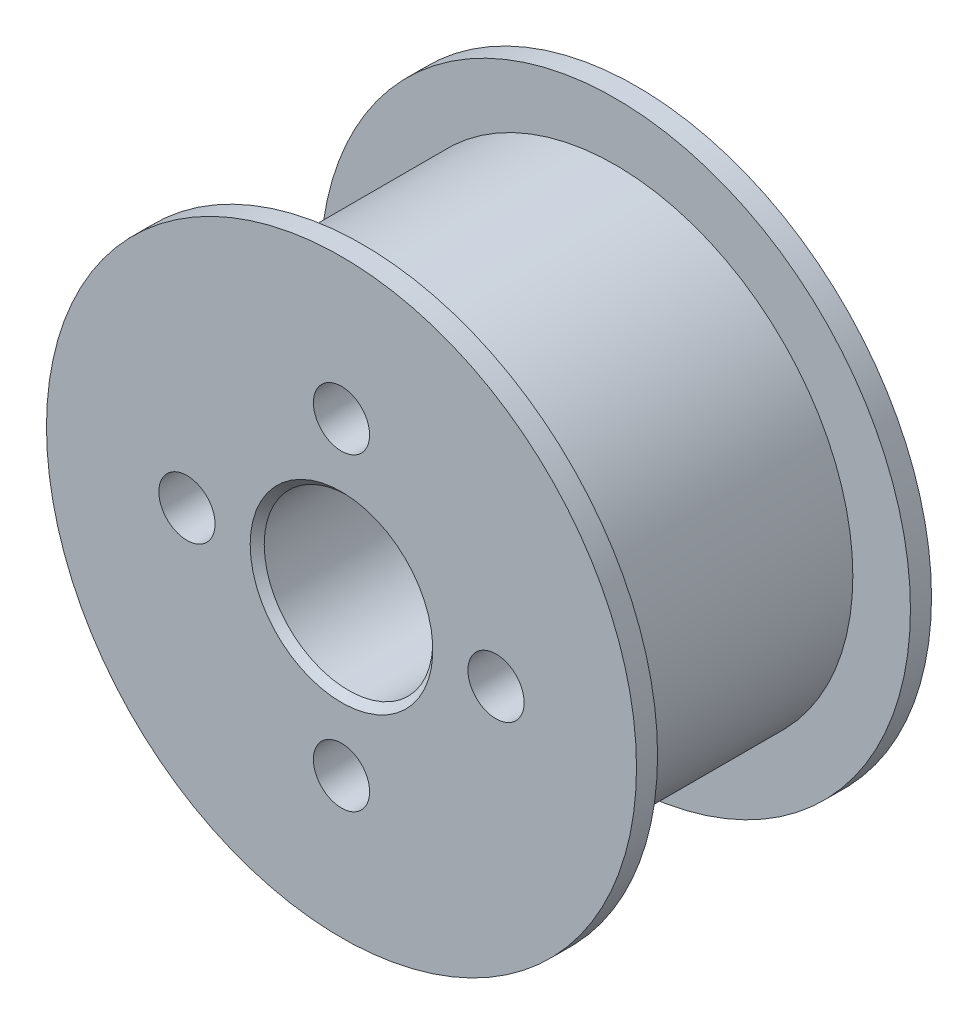
ISO-10303-21;
HEADER;
FILE_DESCRIPTION(('STEP AP214'),'2;1');
FILE_NAME('part.step','',(''),(''),'','','');
FILE_SCHEMA(('AUTOMOTIVE_DESIGN { 1 0 10303 214 1 1 1 1 }'));
ENDSEC;
DATA;
#1=APPLICATION_CONTEXT('core data for automotive mechanical design processes');
#2=APPLICATION_PROTOCOL_DEFINITION('international standard','automotive_design',2000,#1);
#3=PRODUCT_CONTEXT('',#1,'mechanical');
#4=PRODUCT('Part','Part','',(#3));
#5=PRODUCT_RELATED_PRODUCT_CATEGORY('part','',(#4));
#6=PRODUCT_DEFINITION_FORMATION('','',#4);
#7=PRODUCT_DEFINITION_CONTEXT('part definition',#1,'design');
#8=PRODUCT_DEFINITION('design','',#6,#7);
#9=PRODUCT_DEFINITION_SHAPE('','',#8);
#10=(LENGTH_UNIT() NAMED_UNIT(*) SI_UNIT(.MILLI.,.METRE.));
#11=(NAMED_UNIT(*) PLANE_ANGLE_UNIT() SI_UNIT($,.RADIAN.));
#12=(NAMED_UNIT(*) SI_UNIT($,.STERADIAN.) SOLID_ANGLE_UNIT());
#13=UNCERTAINTY_MEASURE_WITH_UNIT(LENGTH_MEASURE(1.E-05),#10,'distance_accuracy_value','');
#14=(GEOMETRIC_REPRESENTATION_CONTEXT(3) GLOBAL_UNCERTAINTY_ASSIGNED_CONTEXT((#13)) GLOBAL_UNIT_ASSIGNED_CONTEXT((#10,
#11,#12)) REPRESENTATION_CONTEXT('',''));
#15=CARTESIAN_POINT('',(0.,0.,0.));
#16=DIRECTION('',(0.,0.,1.));
#17=DIRECTION('',(1.,0.,0.));
#18=AXIS2_PLACEMENT_3D('',#15,#16,#17);
#19=CARTESIAN_POINT('',(0.,13.,-26.));
#20=DIRECTION('',(0.,0.,1.));
#21=DIRECTION('',(1.,0.,0.));
#22=AXIS2_PLACEMENT_3D('',#19,#20,#21);
#23=PLANE('',#22);
#24=CARTESIAN_POINT('',(0.,0.,-26.));
#25=DIRECTION('',(0.,0.,-1.));
#26=DIRECTION('',(0.,1.,0.));
#27=AXIS2_PLACEMENT_3D('',#24,#25,#26);
#28=CIRCLE('',#27,6.);
#29=CARTESIAN_POINT('',(0.,6.,-26.));
#30=VERTEX_POINT('',#29);
#31=EDGE_CURVE('E151',#30,#30,#28,.T.);
#32=ORIENTED_EDGE('',*,*,#31,.F.);
#33=EDGE_LOOP('',(#32));
#34=FACE_BOUND('',#33,.T.);
#35=CARTESIAN_POINT('',(0.,11.,-26.));
#36=DIRECTION('',(0.,0.,-1.));
#37=DIRECTION('',(-1.,0.,0.));
#38=AXIS2_PLACEMENT_3D('',#35,#36,#37);
#39=CIRCLE('',#38,3.99999999999999);
#40=CARTESIAN_POINT('',(3.72616391489439,12.4545454545455,-26.));
#41=VERTEX_POINT('',#40);
#42=CARTESIAN_POINT('',(-3.72616391489439,12.4545454545455,-26.));
#43=VERTEX_POINT('',#42);
#44=EDGE_CURVE('E105',#41,#43,#39,.T.);
#45=ORIENTED_EDGE('',*,*,#44,.F.);
#46=CARTESIAN_POINT('',(0.,0.,-26.));
#47=DIRECTION('',(0.,0.,1.));
#48=DIRECTION('',(1.,0.,0.));
#49=AXIS2_PLACEMENT_3D('',#46,#47,#48);
#50=CIRCLE('',#49,13.);
#51=CARTESIAN_POINT('',(12.4545454545455,3.72616391489439,-26.));
#52=VERTEX_POINT('',#51);
#53=EDGE_CURVE('E114',#52,#41,#50,.T.);
#54=ORIENTED_EDGE('',*,*,#53,.F.);
#55=CARTESIAN_POINT('',(11.,0.,-26.));
#56=DIRECTION('',(0.,0.,-1.));
#57=DIRECTION('',(-1.,0.,0.));
#58=AXIS2_PLACEMENT_3D('',#55,#56,#57);
#59=CIRCLE('',#58,3.99999999999999);
#60=CARTESIAN_POINT('',(12.4545454545455,-3.72616391489439,-26.));
#61=VERTEX_POINT('',#60);
#62=EDGE_CURVE('E166',#61,#52,#59,.T.);
#63=ORIENTED_EDGE('',*,*,#62,.F.);
#64=CARTESIAN_POINT('',(3.72616391489439,-12.4545454545455,-26.));
#65=VERTEX_POINT('',#64);
#66=EDGE_CURVE('E122',#65,#61,#50,.T.);
#67=ORIENTED_EDGE('',*,*,#66,.F.);
#68=CARTESIAN_POINT('',(0.,-11.,-26.));
#69=DIRECTION('',(0.,0.,-1.));
#70=DIRECTION('',(-1.,0.,0.));
#71=AXIS2_PLACEMENT_3D('',#68,#69,#70);
#72=CIRCLE('',#71,3.99999999999999);
#73=CARTESIAN_POINT('',(-3.72616391489439,-12.4545454545455,-26.));
#74=VERTEX_POINT('',#73);
#75=EDGE_CURVE('E182',#74,#65,#72,.T.);
#76=ORIENTED_EDGE('',*,*,#75,.F.);
#77=CARTESIAN_POINT('',(-12.4545454545455,-3.72616391489439,-26.));
#78=VERTEX_POINT('',#77);
#79=EDGE_CURVE('E126',#78,#74,#50,.T.);
#80=ORIENTED_EDGE('',*,*,#79,.F.);
#81=CARTESIAN_POINT('',(-11.,0.,-26.));
#82=DIRECTION('',(0.,0.,-1.));
#83=DIRECTION('',(-1.,0.,0.));
#84=AXIS2_PLACEMENT_3D('',#81,#82,#83);
#85=CIRCLE('',#84,3.99999999999999);
#86=CARTESIAN_POINT('',(-12.4545454545455,3.72616391489439,-26.));
#87=VERTEX_POINT('',#86);
#88=EDGE_CURVE('E197',#87,#78,#85,.T.);
#89=ORIENTED_EDGE('',*,*,#88,.F.);
#90=EDGE_CURVE('E208',#43,#87,#50,.T.);
#91=ORIENTED_EDGE('',*,*,#90,.F.);
#92=EDGE_LOOP('',(#45,#54,#63,#67,#76,#80,#89,#91));
#93=FACE_BOUND('',#92,.T.);
#94=ADVANCED_FACE('F35',(#34,#93),#23,.F.);
#95=CARTESIAN_POINT('',(0.,0.,0.));
#96=DIRECTION('',(0.,0.,1.));
#97=DIRECTION('',(1.,0.,0.));
#98=AXIS2_PLACEMENT_3D('',#95,#96,#97);
#99=CYLINDRICAL_SURFACE('',#98,13.);
#100=CARTESIAN_POINT('',(0.,0.,-21.));
#101=DIRECTION('',(0.,0.,1.));
#102=DIRECTION('',(1.,0.,0.));
#103=AXIS2_PLACEMENT_3D('',#100,#101,#102);
#104=CIRCLE('',#103,13.);
#105=CARTESIAN_POINT('',(-3.7261639148944,12.4545454545455,-21.));
#106=VERTEX_POINT('',#105);
#107=CARTESIAN_POINT('',(-12.4545454545455,3.7261639148944,-21.));
#108=VERTEX_POINT('',#107);
#109=EDGE_CURVE('E123',#106,#108,#104,.T.);
#110=ORIENTED_EDGE('',*,*,#109,.F.);
#111=DIRECTION('',(0.,0.,-1.));
#112=VECTOR('',#111,1.);
#113=CARTESIAN_POINT('',(-3.72616391489439,12.4545454545455,-23.5));
#114=LINE('',#113,#112);
#115=EDGE_CURVE('E102',#106,#43,#114,.T.);
#116=ORIENTED_EDGE('',*,*,#115,.T.);
#117=ORIENTED_EDGE('',*,*,#90,.T.);
#118=DIRECTION('',(0.,0.,-1.));
#119=VECTOR('',#118,1.);
#120=CARTESIAN_POINT('',(-12.4545454545455,3.72616391489439,-23.5));
#121=LINE('',#120,#119);
#122=EDGE_CURVE('E187',#87,#108,#121,.F.);
#123=ORIENTED_EDGE('',*,*,#122,.T.);
#124=EDGE_LOOP('',(#110,#116,#117,#123));
#125=FACE_BOUND('',#124,.T.);
#126=ADVANCED_FACE('F207',(#125),#99,.T.);
#127=CARTESIAN_POINT('',(-12.4545454545455,-3.7261639148944,-21.));
#128=VERTEX_POINT('',#127);
#129=CARTESIAN_POINT('',(-3.7261639148944,-12.4545454545455,-21.));
#130=VERTEX_POINT('',#129);
#131=EDGE_CURVE('E128',#128,#130,#104,.T.);
#132=ORIENTED_EDGE('',*,*,#131,.F.);
#133=DIRECTION('',(0.,0.,-1.));
#134=VECTOR('',#133,1.);
#135=CARTESIAN_POINT('',(-12.4545454545455,-3.72616391489439,-23.5));
#136=LINE('',#135,#134);
#137=EDGE_CURVE('E184',#128,#78,#136,.T.);
#138=ORIENTED_EDGE('',*,*,#137,.T.);
#139=ORIENTED_EDGE('',*,*,#79,.T.);
#140=DIRECTION('',(0.,0.,-1.));
#141=VECTOR('',#140,1.);
#142=CARTESIAN_POINT('',(-3.72616391489439,-12.4545454545455,-23.5));
#143=LINE('',#142,#141);
#144=EDGE_CURVE('E171',#74,#130,#143,.F.);
#145=ORIENTED_EDGE('',*,*,#144,.T.);
#146=EDGE_LOOP('',(#132,#138,#139,#145));
#147=FACE_BOUND('',#146,.T.);
#148=ADVANCED_FACE('F233',(#147),#99,.T.);
#149=CARTESIAN_POINT('',(3.7261639148944,-12.4545454545455,-21.));
#150=VERTEX_POINT('',#149);
#151=CARTESIAN_POINT('',(12.4545454545455,-3.7261639148944,-21.));
#152=VERTEX_POINT('',#151);
#153=EDGE_CURVE('E125',#150,#152,#104,.T.);
#154=ORIENTED_EDGE('',*,*,#153,.F.);
#155=DIRECTION('',(0.,0.,-1.));
#156=VECTOR('',#155,1.);
#157=CARTESIAN_POINT('',(3.72616391489439,-12.4545454545455,-23.5));
#158=LINE('',#157,#156);
#159=EDGE_CURVE('E168',#150,#65,#158,.T.);
#160=ORIENTED_EDGE('',*,*,#159,.T.);
#161=ORIENTED_EDGE('',*,*,#66,.T.);
#162=DIRECTION('',(0.,0.,-1.));
#163=VECTOR('',#162,1.);
#164=CARTESIAN_POINT('',(12.4545454545455,-3.72616391489439,-23.5));
#165=LINE('',#164,#163);
#166=EDGE_CURVE('E156',#61,#152,#165,.F.);
#167=ORIENTED_EDGE('',*,*,#166,.T.);
#168=EDGE_LOOP('',(#154,#160,#161,#167));
#169=FACE_BOUND('',#168,.T.);
#170=ADVANCED_FACE('F238',(#169),#99,.T.);
#171=CARTESIAN_POINT('',(0.,21.,0.));
#172=DIRECTION('',(0.,0.,-1.));
#173=DIRECTION('',(-1.,0.,0.));
#174=AXIS2_PLACEMENT_3D('',#171,#172,#173);
#175=PLANE('',#174);
#176=CARTESIAN_POINT('',(0.,0.,0.));
#177=DIRECTION('',(0.,0.,-1.));
#178=DIRECTION('',(-1.,0.,0.));
#179=AXIS2_PLACEMENT_3D('',#176,#177,#178);
#180=CIRCLE('',#179,6.49999999999999);
#181=CARTESIAN_POINT('',(-6.49999999999999,0.,0.));
#182=VERTEX_POINT('',#181);
#183=EDGE_CURVE('E43',#182,#182,#180,.T.);
#184=ORIENTED_EDGE('',*,*,#183,.T.);
#185=EDGE_LOOP('',(#184));
#186=FACE_BOUND('',#185,.T.);
#187=CARTESIAN_POINT('',(0.,11.,0.));
#188=DIRECTION('',(0.,0.,-1.));
#189=DIRECTION('',(-1.,0.,0.));
#190=AXIS2_PLACEMENT_3D('',#187,#188,#189);
#191=CIRCLE('',#190,2.);
#192=CARTESIAN_POINT('',(-2.,11.,0.));
#193=VERTEX_POINT('',#192);
#194=EDGE_CURVE('E115',#193,#193,#191,.T.);
#195=ORIENTED_EDGE('',*,*,#194,.T.);
#196=EDGE_LOOP('',(#195));
#197=FACE_BOUND('',#196,.T.);
#198=CARTESIAN_POINT('',(-11.,0.,0.));
#199=DIRECTION('',(0.,0.,-1.));
#200=DIRECTION('',(-1.,0.,0.));
#201=AXIS2_PLACEMENT_3D('',#198,#199,#200);
#202=CIRCLE('',#201,2.);
#203=CARTESIAN_POINT('',(-13.,0.,0.));
#204=VERTEX_POINT('',#203);
#205=EDGE_CURVE('E190',#204,#204,#202,.T.);
#206=ORIENTED_EDGE('',*,*,#205,.T.);
#207=EDGE_LOOP('',(#206));
#208=FACE_BOUND('',#207,.T.);
#209=CARTESIAN_POINT('',(0.,-11.,0.));
#210=DIRECTION('',(0.,0.,-1.));
#211=DIRECTION('',(-1.,0.,0.));
#212=AXIS2_PLACEMENT_3D('',#209,#210,#211);
#213=CIRCLE('',#212,2.);
#214=CARTESIAN_POINT('',(-2.,-11.,0.));
#215=VERTEX_POINT('',#214);
#216=EDGE_CURVE('E174',#215,#215,#213,.T.);
#217=ORIENTED_EDGE('',*,*,#216,.T.);
#218=EDGE_LOOP('',(#217));
#219=FACE_BOUND('',#218,.T.);
#220=CARTESIAN_POINT('',(11.,0.,0.));
#221=DIRECTION('',(0.,0.,-1.));
#222=DIRECTION('',(-1.,0.,0.));
#223=AXIS2_PLACEMENT_3D('',#220,#221,#222);
#224=CIRCLE('',#223,2.);
#225=CARTESIAN_POINT('',(9.,0.,0.));
#226=VERTEX_POINT('',#225);
#227=EDGE_CURVE('E159',#226,#226,#224,.T.);
#228=ORIENTED_EDGE('',*,*,#227,.T.);
#229=EDGE_LOOP('',(#228));
#230=FACE_BOUND('',#229,.T.);
#231=CARTESIAN_POINT('',(0.,0.,0.));
#232=DIRECTION('',(0.,0.,1.));
#233=DIRECTION('',(1.,0.,0.));
#234=AXIS2_PLACEMENT_3D('',#231,#232,#233);
#235=CIRCLE('',#234,21.);
#236=CARTESIAN_POINT('',(21.,0.,0.));
#237=VERTEX_POINT('',#236);
#238=EDGE_CURVE('E148',#237,#237,#235,.T.);
#239=ORIENTED_EDGE('',*,*,#238,.T.);
#240=EDGE_LOOP('',(#239));
#241=FACE_BOUND('',#240,.T.);
#242=ADVANCED_FACE('F215',(#186,#197,#208,#219,#230,#241),#175,.F.);
#243=ORIENTED_EDGE('',*,*,#53,.T.);
#244=DIRECTION('',(0.,0.,-1.));
#245=VECTOR('',#244,1.);
#246=CARTESIAN_POINT('',(3.72616391489439,12.4545454545455,-23.5));
#247=LINE('',#246,#245);
#248=CARTESIAN_POINT('',(3.7261639148944,12.4545454545455,-21.));
#249=VERTEX_POINT('',#248);
#250=EDGE_CURVE('E99',#41,#249,#247,.F.);
#251=ORIENTED_EDGE('',*,*,#250,.T.);
#252=CARTESIAN_POINT('',(12.4545454545455,3.7261639148944,-21.));
#253=VERTEX_POINT('',#252);
#254=EDGE_CURVE('E112',#253,#249,#104,.T.);
#255=ORIENTED_EDGE('',*,*,#254,.F.);
#256=DIRECTION('',(0.,0.,-1.));
#257=VECTOR('',#256,1.);
#258=CARTESIAN_POINT('',(12.4545454545455,3.72616391489439,-23.5));
#259=LINE('',#258,#257);
#260=EDGE_CURVE('E154',#253,#52,#259,.T.);
#261=ORIENTED_EDGE('',*,*,#260,.T.);
#262=EDGE_LOOP('',(#243,#251,#255,#261));
#263=FACE_BOUND('',#262,.T.);
#264=ADVANCED_FACE('F110',(#263),#99,.T.);
#265=CARTESIAN_POINT('',(0.,13.,-21.));
#266=DIRECTION('',(0.,0.,1.));
#267=DIRECTION('',(1.,0.,0.));
#268=AXIS2_PLACEMENT_3D('',#265,#266,#267);
#269=PLANE('',#268);
#270=CARTESIAN_POINT('',(0.,11.,-21.));
#271=DIRECTION('',(0.,0.,-1.));
#272=DIRECTION('',(-1.,0.,0.));
#273=AXIS2_PLACEMENT_3D('',#270,#271,#272);
#274=CIRCLE('',#273,2.);
#275=CARTESIAN_POINT('',(-2.,11.,-21.));
#276=VERTEX_POINT('',#275);
#277=EDGE_CURVE('E104',#276,#276,#274,.T.);
#278=ORIENTED_EDGE('',*,*,#277,.F.);
#279=EDGE_LOOP('',(#278));
#280=FACE_BOUND('',#279,.T.);
#281=ORIENTED_EDGE('',*,*,#254,.T.);
#282=CARTESIAN_POINT('',(0.,11.,-21.));
#283=DIRECTION('',(0.,0.,-1.));
#284=DIRECTION('',(-1.,0.,0.));
#285=AXIS2_PLACEMENT_3D('',#282,#283,#284);
#286=CIRCLE('',#285,4.);
#287=EDGE_CURVE('E50',#249,#106,#286,.T.);
#288=ORIENTED_EDGE('',*,*,#287,.T.);
#289=ORIENTED_EDGE('',*,*,#109,.T.);
#290=CARTESIAN_POINT('',(-11.,0.,-21.));
#291=DIRECTION('',(0.,0.,-1.));
#292=DIRECTION('',(-1.,0.,0.));
#293=AXIS2_PLACEMENT_3D('',#290,#291,#292);
#294=CIRCLE('',#293,4.);
#295=EDGE_CURVE('E56',#108,#128,#294,.T.);
#296=ORIENTED_EDGE('',*,*,#295,.T.);
#297=ORIENTED_EDGE('',*,*,#131,.T.);
#298=CARTESIAN_POINT('',(0.,-11.,-21.));
#299=DIRECTION('',(0.,0.,-1.));
#300=DIRECTION('',(-1.,0.,0.));
#301=AXIS2_PLACEMENT_3D('',#298,#299,#300);
#302=CIRCLE('',#301,4.);
#303=EDGE_CURVE('E180',#130,#150,#302,.T.);
#304=ORIENTED_EDGE('',*,*,#303,.T.);
#305=ORIENTED_EDGE('',*,*,#153,.T.);
#306=CARTESIAN_POINT('',(11.,0.,-21.));
#307=DIRECTION('',(0.,0.,-1.));
#308=DIRECTION('',(-1.,0.,0.));
#309=AXIS2_PLACEMENT_3D('',#306,#307,#308);
#310=CIRCLE('',#309,4.);
#311=EDGE_CURVE('E121',#152,#253,#310,.T.);
#312=ORIENTED_EDGE('',*,*,#311,.T.);
#313=EDGE_LOOP('',(#281,#288,#289,#296,#297,#304,#305,#312));
#314=FACE_BOUND('',#313,.T.);
#315=CARTESIAN_POINT('',(0.,-11.,-21.));
#316=DIRECTION('',(0.,0.,-1.));
#317=DIRECTION('',(-1.,0.,0.));
#318=AXIS2_PLACEMENT_3D('',#315,#316,#317);
#319=CIRCLE('',#318,2.);
#320=CARTESIAN_POINT('',(-2.,-11.,-21.));
#321=VERTEX_POINT('',#320);
#322=EDGE_CURVE('E177',#321,#321,#319,.T.);
#323=ORIENTED_EDGE('',*,*,#322,.F.);
#324=EDGE_LOOP('',(#323));
#325=FACE_BOUND('',#324,.T.);
#326=CARTESIAN_POINT('',(0.,0.,-21.));
#327=DIRECTION('',(0.,0.,1.));
#328=DIRECTION('',(1.,0.,0.));
#329=AXIS2_PLACEMENT_3D('',#326,#327,#328);
#330=CIRCLE('',#329,21.);
#331=CARTESIAN_POINT('',(21.,0.,-21.));
#332=VERTEX_POINT('',#331);
#333=EDGE_CURVE('E130',#332,#332,#330,.T.);
#334=ORIENTED_EDGE('',*,*,#333,.F.);
#335=EDGE_LOOP('',(#334));
#336=FACE_BOUND('',#335,.T.);
#337=CARTESIAN_POINT('',(11.,0.,-21.));
#338=DIRECTION('',(0.,0.,-1.));
#339=DIRECTION('',(-1.,0.,0.));
#340=AXIS2_PLACEMENT_3D('',#337,#338,#339);
#341=CIRCLE('',#340,2.);
#342=CARTESIAN_POINT('',(9.,0.,-21.));
#343=VERTEX_POINT('',#342);
#344=EDGE_CURVE('E162',#343,#343,#341,.T.);
#345=ORIENTED_EDGE('',*,*,#344,.F.);
#346=EDGE_LOOP('',(#345));
#347=FACE_BOUND('',#346,.T.);
#348=CARTESIAN_POINT('',(-11.,0.,-21.));
#349=DIRECTION('',(0.,0.,-1.));
#350=DIRECTION('',(-1.,0.,0.));
#351=AXIS2_PLACEMENT_3D('',#348,#349,#350);
#352=CIRCLE('',#351,2.);
#353=CARTESIAN_POINT('',(-13.,0.,-21.));
#354=VERTEX_POINT('',#353);
#355=EDGE_CURVE('E193',#354,#354,#352,.T.);
#356=ORIENTED_EDGE('',*,*,#355,.F.);
#357=EDGE_LOOP('',(#356));
#358=FACE_BOUND('',#357,.T.);
#359=ADVANCED_FACE('F118',(#280,#314,#325,#336,#347,#358),#269,.F.);
#360=CARTESIAN_POINT('',(0.,0.,0.));
#361=DIRECTION('',(0.,0.,1.));
#362=DIRECTION('',(1.,0.,0.));
#363=AXIS2_PLACEMENT_3D('',#360,#361,#362);
#364=CYLINDRICAL_SURFACE('',#363,21.);
#365=CARTESIAN_POINT('',(0.,0.,-19.5));
#366=DIRECTION('',(0.,0.,1.));
#367=DIRECTION('',(1.,0.,0.));
#368=AXIS2_PLACEMENT_3D('',#365,#366,#367);
#369=CIRCLE('',#368,21.);
#370=CARTESIAN_POINT('',(21.,0.,-19.5));
#371=VERTEX_POINT('',#370);
#372=EDGE_CURVE('E133',#371,#371,#369,.T.);
#373=ORIENTED_EDGE('',*,*,#372,.F.);
#374=EDGE_LOOP('',(#373));
#375=FACE_BOUND('',#374,.T.);
#376=ORIENTED_EDGE('',*,*,#333,.T.);
#377=EDGE_LOOP('',(#376));
#378=FACE_BOUND('',#377,.T.);
#379=ADVANCED_FACE('F303',(#375,#378),#364,.T.);
#380=CARTESIAN_POINT('',(0.,16.9,-19.5));
#381=DIRECTION('',(0.,0.,-1.));
#382=DIRECTION('',(-1.,0.,0.));
#383=AXIS2_PLACEMENT_3D('',#380,#381,#382);
#384=PLANE('',#383);
#385=CARTESIAN_POINT('',(0.,0.,-19.5));
#386=DIRECTION('',(0.,0.,1.));
#387=DIRECTION('',(1.,0.,0.));
#388=AXIS2_PLACEMENT_3D('',#385,#386,#387);
#389=CIRCLE('',#388,16.9);
#390=CARTESIAN_POINT('',(16.9,0.,-19.5));
#391=VERTEX_POINT('',#390);
#392=EDGE_CURVE('E137',#391,#391,#389,.T.);
#393=ORIENTED_EDGE('',*,*,#392,.F.);
#394=EDGE_LOOP('',(#393));
#395=FACE_BOUND('',#394,.T.);
#396=ORIENTED_EDGE('',*,*,#372,.T.);
#397=EDGE_LOOP('',(#396));
#398=FACE_BOUND('',#397,.T.);
#399=ADVANCED_FACE('F299',(#395,#398),#384,.F.);
#400=CARTESIAN_POINT('',(0.,0.,0.));
#401=DIRECTION('',(0.,0.,1.));
#402=DIRECTION('',(1.,0.,0.));
#403=AXIS2_PLACEMENT_3D('',#400,#401,#402);
#404=CYLINDRICAL_SURFACE('',#403,16.9);
#405=CARTESIAN_POINT('',(0.,0.,-1.5));
#406=DIRECTION('',(0.,0.,1.));
#407=DIRECTION('',(1.,0.,0.));
#408=AXIS2_PLACEMENT_3D('',#405,#406,#407);
#409=CIRCLE('',#408,16.9);
#410=CARTESIAN_POINT('',(16.9,0.,-1.5));
#411=VERTEX_POINT('',#410);
#412=EDGE_CURVE('E142',#411,#411,#409,.T.);
#413=ORIENTED_EDGE('',*,*,#412,.F.);
#414=EDGE_LOOP('',(#413));
#415=FACE_BOUND('',#414,.T.);
#416=ORIENTED_EDGE('',*,*,#392,.T.);
#417=EDGE_LOOP('',(#416));
#418=FACE_BOUND('',#417,.T.);
#419=ADVANCED_FACE('F295',(#415,#418),#404,.T.);
#420=CARTESIAN_POINT('',(0.,21.,-1.5));
#421=DIRECTION('',(0.,0.,1.));
#422=DIRECTION('',(1.,0.,0.));
#423=AXIS2_PLACEMENT_3D('',#420,#421,#422);
#424=PLANE('',#423);
#425=CARTESIAN_POINT('',(0.,0.,-1.5));
#426=DIRECTION('',(0.,0.,1.));
#427=DIRECTION('',(1.,0.,0.));
#428=AXIS2_PLACEMENT_3D('',#425,#426,#427);
#429=CIRCLE('',#428,21.);
#430=CARTESIAN_POINT('',(21.,0.,-1.5));
#431=VERTEX_POINT('',#430);
#432=EDGE_CURVE('E145',#431,#431,#429,.T.);
#433=ORIENTED_EDGE('',*,*,#432,.F.);
#434=EDGE_LOOP('',(#433));
#435=FACE_BOUND('',#434,.T.);
#436=ORIENTED_EDGE('',*,*,#412,.T.);
#437=EDGE_LOOP('',(#436));
#438=FACE_BOUND('',#437,.T.);
#439=ADVANCED_FACE('F291',(#435,#438),#424,.F.);
#440=CARTESIAN_POINT('',(0.,0.,0.));
#441=DIRECTION('',(0.,0.,1.));
#442=DIRECTION('',(1.,0.,0.));
#443=AXIS2_PLACEMENT_3D('',#440,#441,#442);
#444=CYLINDRICAL_SURFACE('',#443,21.);
#445=ORIENTED_EDGE('',*,*,#238,.F.);
#446=EDGE_LOOP('',(#445));
#447=FACE_BOUND('',#446,.T.);
#448=ORIENTED_EDGE('',*,*,#432,.T.);
#449=EDGE_LOOP('',(#448));
#450=FACE_BOUND('',#449,.T.);
#451=ADVANCED_FACE('F287',(#447,#450),#444,.T.);
#452=CARTESIAN_POINT('',(0.,0.,0.));
#453=DIRECTION('',(0.,0.,-1.));
#454=DIRECTION('',(0.,1.,0.));
#455=AXIS2_PLACEMENT_3D('',#452,#453,#454);
#456=CYLINDRICAL_SURFACE('',#455,6.);
#457=CARTESIAN_POINT('',(0.,0.,-0.499999999999987));
#458=DIRECTION('',(0.,0.,-1.));
#459=DIRECTION('',(0.,1.,0.));
#460=AXIS2_PLACEMENT_3D('',#457,#458,#459);
#461=CIRCLE('',#460,6.);
#462=CARTESIAN_POINT('',(0.,6.,-0.499999999999987));
#463=VERTEX_POINT('',#462);
#464=EDGE_CURVE('E11',#463,#463,#461,.F.);
#465=ORIENTED_EDGE('',*,*,#464,.T.);
#466=EDGE_LOOP('',(#465));
#467=FACE_BOUND('',#466,.T.);
#468=ORIENTED_EDGE('',*,*,#31,.T.);
#469=EDGE_LOOP('',(#468));
#470=FACE_BOUND('',#469,.T.);
#471=ADVANCED_FACE('F281',(#467,#470),#456,.F.);
#472=CARTESIAN_POINT('',(11.,0.,-26.));
#473=DIRECTION('',(0.,0.,-1.));
#474=DIRECTION('',(-1.,0.,0.));
#475=AXIS2_PLACEMENT_3D('',#472,#473,#474);
#476=CYLINDRICAL_SURFACE('',#475,3.99999999999999);
#477=ORIENTED_EDGE('',*,*,#311,.F.);
#478=ORIENTED_EDGE('',*,*,#166,.F.);
#479=ORIENTED_EDGE('',*,*,#62,.T.);
#480=ORIENTED_EDGE('',*,*,#260,.F.);
#481=EDGE_LOOP('',(#477,#478,#479,#480));
#482=FACE_BOUND('',#481,.T.);
#483=ADVANCED_FACE('F253',(#482),#476,.F.);
#484=CARTESIAN_POINT('',(11.,0.,-26.));
#485=DIRECTION('',(0.,0.,-1.));
#486=DIRECTION('',(-1.,0.,0.));
#487=AXIS2_PLACEMENT_3D('',#484,#485,#486);
#488=CYLINDRICAL_SURFACE('',#487,2.);
#489=ORIENTED_EDGE('',*,*,#227,.F.);
#490=EDGE_LOOP('',(#489));
#491=FACE_BOUND('',#490,.T.);
#492=ORIENTED_EDGE('',*,*,#344,.T.);
#493=EDGE_LOOP('',(#492));
#494=FACE_BOUND('',#493,.T.);
#495=ADVANCED_FACE('F277',(#491,#494),#488,.F.);
#496=CARTESIAN_POINT('',(0.,-11.,-26.));
#497=DIRECTION('',(0.,0.,-1.));
#498=DIRECTION('',(-1.,0.,0.));
#499=AXIS2_PLACEMENT_3D('',#496,#497,#498);
#500=CYLINDRICAL_SURFACE('',#499,3.99999999999999);
#501=ORIENTED_EDGE('',*,*,#303,.F.);
#502=ORIENTED_EDGE('',*,*,#144,.F.);
#503=ORIENTED_EDGE('',*,*,#75,.T.);
#504=ORIENTED_EDGE('',*,*,#159,.F.);
#505=EDGE_LOOP('',(#501,#502,#503,#504));
#506=FACE_BOUND('',#505,.T.);
#507=ADVANCED_FACE('F258',(#506),#500,.F.);
#508=CARTESIAN_POINT('',(0.,-11.,-26.));
#509=DIRECTION('',(0.,0.,-1.));
#510=DIRECTION('',(-1.,0.,0.));
#511=AXIS2_PLACEMENT_3D('',#508,#509,#510);
#512=CYLINDRICAL_SURFACE('',#511,2.);
#513=ORIENTED_EDGE('',*,*,#216,.F.);
#514=EDGE_LOOP('',(#513));
#515=FACE_BOUND('',#514,.T.);
#516=ORIENTED_EDGE('',*,*,#322,.T.);
#517=EDGE_LOOP('',(#516));
#518=FACE_BOUND('',#517,.T.);
#519=ADVANCED_FACE('F264',(#515,#518),#512,.F.);
#520=CARTESIAN_POINT('',(-11.,0.,-26.));
#521=DIRECTION('',(0.,0.,-1.));
#522=DIRECTION('',(-1.,0.,0.));
#523=AXIS2_PLACEMENT_3D('',#520,#521,#522);
#524=CYLINDRICAL_SURFACE('',#523,3.99999999999999);
#525=ORIENTED_EDGE('',*,*,#295,.F.);
#526=ORIENTED_EDGE('',*,*,#122,.F.);
#527=ORIENTED_EDGE('',*,*,#88,.T.);
#528=ORIENTED_EDGE('',*,*,#137,.F.);
#529=EDGE_LOOP('',(#525,#526,#527,#528));
#530=FACE_BOUND('',#529,.T.);
#531=ADVANCED_FACE('F261',(#530),#524,.F.);
#532=CARTESIAN_POINT('',(-11.,0.,-26.));
#533=DIRECTION('',(0.,0.,-1.));
#534=DIRECTION('',(-1.,0.,0.));
#535=AXIS2_PLACEMENT_3D('',#532,#533,#534);
#536=CYLINDRICAL_SURFACE('',#535,2.);
#537=ORIENTED_EDGE('',*,*,#205,.F.);
#538=EDGE_LOOP('',(#537));
#539=FACE_BOUND('',#538,.T.);
#540=ORIENTED_EDGE('',*,*,#355,.T.);
#541=EDGE_LOOP('',(#540));
#542=FACE_BOUND('',#541,.T.);
#543=ADVANCED_FACE('F263',(#539,#542),#536,.F.);
#544=CARTESIAN_POINT('',(0.,11.,-26.));
#545=DIRECTION('',(0.,0.,-1.));
#546=DIRECTION('',(-1.,0.,0.));
#547=AXIS2_PLACEMENT_3D('',#544,#545,#546);
#548=CYLINDRICAL_SURFACE('',#547,3.99999999999999);
#549=ORIENTED_EDGE('',*,*,#287,.F.);
#550=ORIENTED_EDGE('',*,*,#250,.F.);
#551=ORIENTED_EDGE('',*,*,#44,.T.);
#552=ORIENTED_EDGE('',*,*,#115,.F.);
#553=EDGE_LOOP('',(#549,#550,#551,#552));
#554=FACE_BOUND('',#553,.T.);
#555=ADVANCED_FACE('F98',(#554),#548,.F.);
#556=CARTESIAN_POINT('',(0.,11.,-26.));
#557=DIRECTION('',(0.,0.,-1.));
#558=DIRECTION('',(-1.,0.,0.));
#559=AXIS2_PLACEMENT_3D('',#556,#557,#558);
#560=CYLINDRICAL_SURFACE('',#559,2.);
#561=ORIENTED_EDGE('',*,*,#194,.F.);
#562=EDGE_LOOP('',(#561));
#563=FACE_BOUND('',#562,.T.);
#564=ORIENTED_EDGE('',*,*,#277,.T.);
#565=EDGE_LOOP('',(#564));
#566=FACE_BOUND('',#565,.T.);
#567=ADVANCED_FACE('F219',(#563,#566),#560,.F.);
#568=CARTESIAN_POINT('',(0.,0.,0.));
#569=DIRECTION('',(0.,0.,1.));
#570=DIRECTION('',(0.,-1.,0.));
#571=AXIS2_PLACEMENT_3D('',#568,#569,#570);
#572=CONICAL_SURFACE('',#571,6.49999999999999,0.785398163397449);
#573=ORIENTED_EDGE('',*,*,#464,.F.);
#574=EDGE_LOOP('',(#573));
#575=FACE_BOUND('',#574,.T.);
#576=ORIENTED_EDGE('',*,*,#183,.F.);
#577=EDGE_LOOP('',(#576));
#578=FACE_BOUND('',#577,.T.);
#579=ADVANCED_FACE('F37',(#575,#578),#572,.F.);
#580=CLOSED_SHELL('',(#94,#126,#148,#170,#242,#264,#359,#379,#399,#419,#439,#451,#471,#483,#495,
#507,#519,#531,#543,#555,#567,#579));
#581=MANIFOLD_SOLID_BREP('B2',#580);
#582=ADVANCED_BREP_SHAPE_REPRESENTATION('',(#18,#581),#14);
#583=SHAPE_DEFINITION_REPRESENTATION(#9,#582);
ENDSEC;
END-ISO-10303-21;
